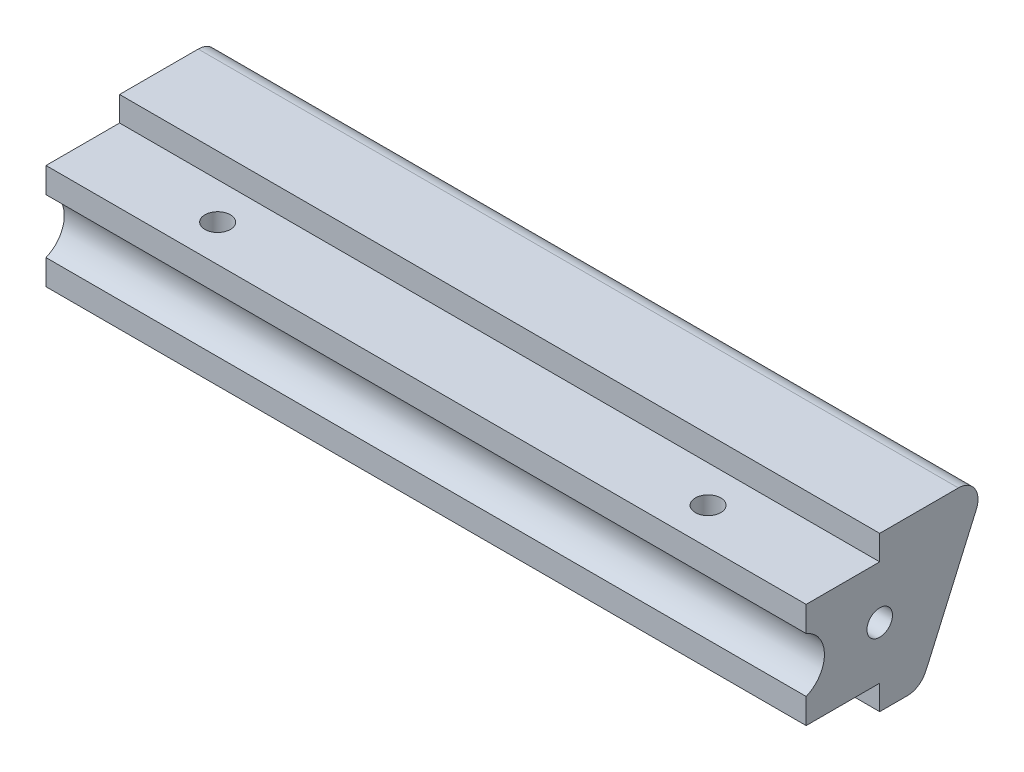
ISO-10303-21;
HEADER;
FILE_DESCRIPTION(('STEP AP214'),'2;1');
FILE_NAME('part.step','',(''),(''),'','','');
FILE_SCHEMA(('AUTOMOTIVE_DESIGN { 1 0 10303 214 1 1 1 1 }'));
ENDSEC;
DATA;
#1=APPLICATION_CONTEXT('core data for automotive mechanical design processes');
#2=APPLICATION_PROTOCOL_DEFINITION('international standard','automotive_design',2000,#1);
#3=PRODUCT_CONTEXT('',#1,'mechanical');
#4=PRODUCT('Part','Part','',(#3));
#5=PRODUCT_RELATED_PRODUCT_CATEGORY('part','',(#4));
#6=PRODUCT_DEFINITION_FORMATION('','',#4);
#7=PRODUCT_DEFINITION_CONTEXT('part definition',#1,'design');
#8=PRODUCT_DEFINITION('design','',#6,#7);
#9=PRODUCT_DEFINITION_SHAPE('','',#8);
#10=(LENGTH_UNIT() NAMED_UNIT(*) SI_UNIT(.MILLI.,.METRE.));
#11=(NAMED_UNIT(*) PLANE_ANGLE_UNIT() SI_UNIT($,.RADIAN.));
#12=(NAMED_UNIT(*) SI_UNIT($,.STERADIAN.) SOLID_ANGLE_UNIT());
#13=UNCERTAINTY_MEASURE_WITH_UNIT(LENGTH_MEASURE(1.E-05),#10,'distance_accuracy_value','');
#14=(GEOMETRIC_REPRESENTATION_CONTEXT(3) GLOBAL_UNCERTAINTY_ASSIGNED_CONTEXT((#13)) GLOBAL_UNIT_ASSIGNED_CONTEXT((#10,
#11,#12)) REPRESENTATION_CONTEXT('',''));
#15=CARTESIAN_POINT('',(0.,0.,0.));
#16=DIRECTION('',(0.,0.,1.));
#17=DIRECTION('',(1.,0.,0.));
#18=AXIS2_PLACEMENT_3D('',#15,#16,#17);
#19=CARTESIAN_POINT('',(98.425,16.7996,0.));
#20=DIRECTION('',(0.,0.,-1.));
#21=DIRECTION('',(0.,1.,0.));
#22=AXIS2_PLACEMENT_3D('',#19,#20,#21);
#23=PLANE('',#22);
#24=DIRECTION('',(0.,-1.,0.));
#25=VECTOR('',#24,1.);
#26=CARTESIAN_POINT('',(98.425,16.7996,0.));
#27=LINE('',#26,#25);
#28=CARTESIAN_POINT('',(98.425,6.4737188141613,0.));
#29=VERTEX_POINT('',#28);
#30=CARTESIAN_POINT('',(98.425,3.2004,0.));
#31=VERTEX_POINT('',#30);
#32=EDGE_CURVE('E145',#29,#31,#27,.T.);
#33=ORIENTED_EDGE('',*,*,#32,.F.);
#34=DIRECTION('',(-1.,0.,0.));
#35=VECTOR('',#34,1.);
#36=CARTESIAN_POINT('',(105.864264117156,6.4737188141613,0.));
#37=LINE('',#36,#35);
#38=CARTESIAN_POINT('',(0.,6.4737188141613,0.));
#39=VERTEX_POINT('',#38);
#40=EDGE_CURVE('E130',#29,#39,#37,.T.);
#41=ORIENTED_EDGE('',*,*,#40,.T.);
#42=DIRECTION('',(0.,-1.,0.));
#43=VECTOR('',#42,1.);
#44=CARTESIAN_POINT('',(0.,16.7996,0.));
#45=LINE('',#44,#43);
#46=CARTESIAN_POINT('',(0.,3.2004,0.));
#47=VERTEX_POINT('',#46);
#48=EDGE_CURVE('E143',#39,#47,#45,.T.);
#49=ORIENTED_EDGE('',*,*,#48,.T.);
#50=DIRECTION('',(-1.,0.,0.));
#51=VECTOR('',#50,1.);
#52=CARTESIAN_POINT('',(98.425,3.2004,0.));
#53=LINE('',#52,#51);
#54=EDGE_CURVE('E180',#31,#47,#53,.T.);
#55=ORIENTED_EDGE('',*,*,#54,.F.);
#56=EDGE_LOOP('',(#33,#41,#49,#55));
#57=FACE_BOUND('',#56,.T.);
#58=ADVANCED_FACE('F33',(#57),#23,.F.);
#59=CARTESIAN_POINT('',(98.425,20.,-23.603930171705));
#60=DIRECTION('',(0.,-1.,0.));
#61=DIRECTION('',(0.,0.,-1.));
#62=AXIS2_PLACEMENT_3D('',#59,#60,#61);
#63=PLANE('',#62);
#64=DIRECTION('',(0.,0.,1.));
#65=VECTOR('',#64,1.);
#66=CARTESIAN_POINT('',(98.425,20.,-23.603930171705));
#67=LINE('',#66,#65);
#68=CARTESIAN_POINT('',(98.425,20.,-19.7136079095898));
#69=VERTEX_POINT('',#68);
#70=CARTESIAN_POINT('',(98.425,20.,-9.525));
#71=VERTEX_POINT('',#70);
#72=EDGE_CURVE('E169',#69,#71,#67,.T.);
#73=ORIENTED_EDGE('',*,*,#72,.F.);
#74=DIRECTION('',(-1.,0.,0.));
#75=VECTOR('',#74,1.);
#76=CARTESIAN_POINT('',(98.425,20.,-19.7136079095898));
#77=LINE('',#76,#75);
#78=CARTESIAN_POINT('',(0.,20.,-19.7136079095898));
#79=VERTEX_POINT('',#78);
#80=EDGE_CURVE('E41',#69,#79,#77,.T.);
#81=ORIENTED_EDGE('',*,*,#80,.T.);
#82=DIRECTION('',(0.,0.,1.));
#83=VECTOR('',#82,1.);
#84=CARTESIAN_POINT('',(0.,20.,-23.603930171705));
#85=LINE('',#84,#83);
#86=CARTESIAN_POINT('',(0.,20.,-9.525));
#87=VERTEX_POINT('',#86);
#88=EDGE_CURVE('E208',#79,#87,#85,.T.);
#89=ORIENTED_EDGE('',*,*,#88,.T.);
#90=DIRECTION('',(-1.,0.,0.));
#91=VECTOR('',#90,1.);
#92=CARTESIAN_POINT('',(98.425,20.,-9.525));
#93=LINE('',#92,#91);
#94=EDGE_CURVE('E188',#71,#87,#93,.T.);
#95=ORIENTED_EDGE('',*,*,#94,.F.);
#96=EDGE_LOOP('',(#73,#81,#89,#95));
#97=FACE_BOUND('',#96,.T.);
#98=ADVANCED_FACE('F206',(#97),#63,.F.);
#99=CARTESIAN_POINT('',(98.425,20.,-9.525));
#100=DIRECTION('',(0.,0.,-1.));
#101=DIRECTION('',(-1.,0.,0.));
#102=AXIS2_PLACEMENT_3D('',#99,#100,#101);
#103=PLANE('',#102);
#104=DIRECTION('',(0.,-1.,0.));
#105=VECTOR('',#104,1.);
#106=CARTESIAN_POINT('',(0.,20.,-9.525));
#107=LINE('',#106,#105);
#108=CARTESIAN_POINT('',(0.,16.7996,-9.525));
#109=VERTEX_POINT('',#108);
#110=EDGE_CURVE('E155',#87,#109,#107,.T.);
#111=ORIENTED_EDGE('',*,*,#110,.T.);
#112=DIRECTION('',(-1.,0.,0.));
#113=VECTOR('',#112,1.);
#114=CARTESIAN_POINT('',(98.425,16.7996,-9.525));
#115=LINE('',#114,#113);
#116=CARTESIAN_POINT('',(98.425,16.7996,-9.525));
#117=VERTEX_POINT('',#116);
#118=EDGE_CURVE('E185',#117,#109,#115,.T.);
#119=ORIENTED_EDGE('',*,*,#118,.F.);
#120=DIRECTION('',(0.,-1.,0.));
#121=VECTOR('',#120,1.);
#122=CARTESIAN_POINT('',(98.425,20.,-9.525));
#123=LINE('',#122,#121);
#124=EDGE_CURVE('E232',#71,#117,#123,.T.);
#125=ORIENTED_EDGE('',*,*,#124,.F.);
#126=ORIENTED_EDGE('',*,*,#94,.T.);
#127=EDGE_LOOP('',(#111,#119,#125,#126));
#128=FACE_BOUND('',#127,.T.);
#129=ADVANCED_FACE('F288',(#128),#103,.F.);
#130=CARTESIAN_POINT('',(98.425,16.7996,-9.525));
#131=DIRECTION('',(0.,-1.,0.));
#132=DIRECTION('',(0.,0.,-1.));
#133=AXIS2_PLACEMENT_3D('',#130,#131,#132);
#134=PLANE('',#133);
#135=CARTESIAN_POINT('',(17.4625,16.7996,-4.76250000000001));
#136=DIRECTION('',(0.,1.,0.));
#137=DIRECTION('',(0.,0.,1.));
#138=AXIS2_PLACEMENT_3D('',#135,#136,#137);
#139=CIRCLE('',#138,1.651);
#140=CARTESIAN_POINT('',(17.4625,16.7996,-3.11150000000001));
#141=VERTEX_POINT('',#140);
#142=EDGE_CURVE('E239',#141,#141,#139,.T.);
#143=ORIENTED_EDGE('',*,*,#142,.F.);
#144=EDGE_LOOP('',(#143));
#145=FACE_BOUND('',#144,.T.);
#146=CARTESIAN_POINT('',(80.9625,16.7996,-4.76250000000005));
#147=DIRECTION('',(0.,1.,0.));
#148=DIRECTION('',(0.,0.,1.));
#149=AXIS2_PLACEMENT_3D('',#146,#147,#148);
#150=CIRCLE('',#149,1.65100000000001);
#151=CARTESIAN_POINT('',(80.9625,16.7996,-3.11150000000004));
#152=VERTEX_POINT('',#151);
#153=EDGE_CURVE('E240',#152,#152,#150,.T.);
#154=ORIENTED_EDGE('',*,*,#153,.F.);
#155=EDGE_LOOP('',(#154));
#156=FACE_BOUND('',#155,.T.);
#157=DIRECTION('',(0.,0.,1.));
#158=VECTOR('',#157,1.);
#159=CARTESIAN_POINT('',(0.,16.7996,-9.525));
#160=LINE('',#159,#158);
#161=CARTESIAN_POINT('',(0.,16.7996,0.));
#162=VERTEX_POINT('',#161);
#163=EDGE_CURVE('E153',#109,#162,#160,.T.);
#164=ORIENTED_EDGE('',*,*,#163,.T.);
#165=DIRECTION('',(-1.,0.,0.));
#166=VECTOR('',#165,1.);
#167=CARTESIAN_POINT('',(98.425,16.7996,0.));
#168=LINE('',#167,#166);
#169=CARTESIAN_POINT('',(98.425,16.7996,0.));
#170=VERTEX_POINT('',#169);
#171=EDGE_CURVE('E182',#170,#162,#168,.T.);
#172=ORIENTED_EDGE('',*,*,#171,.F.);
#173=DIRECTION('',(0.,0.,1.));
#174=VECTOR('',#173,1.);
#175=CARTESIAN_POINT('',(98.425,16.7996,-9.525));
#176=LINE('',#175,#174);
#177=EDGE_CURVE('E230',#117,#170,#176,.T.);
#178=ORIENTED_EDGE('',*,*,#177,.F.);
#179=ORIENTED_EDGE('',*,*,#118,.T.);
#180=EDGE_LOOP('',(#164,#172,#178,#179));
#181=FACE_BOUND('',#180,.T.);
#182=ADVANCED_FACE('F294',(#145,#156,#181),#134,.F.);
#183=CARTESIAN_POINT('',(0.,13.5262811858387,0.));
#184=VERTEX_POINT('',#183);
#185=EDGE_CURVE('E152',#162,#184,#45,.T.);
#186=ORIENTED_EDGE('',*,*,#185,.T.);
#187=DIRECTION('',(-1.,0.,0.));
#188=VECTOR('',#187,1.);
#189=CARTESIAN_POINT('',(105.864264117156,13.5262811858387,0.));
#190=LINE('',#189,#188);
#191=CARTESIAN_POINT('',(98.425,13.5262811858387,0.));
#192=VERTEX_POINT('',#191);
#193=EDGE_CURVE('E133',#192,#184,#190,.T.);
#194=ORIENTED_EDGE('',*,*,#193,.F.);
#195=EDGE_CURVE('E227',#170,#192,#27,.T.);
#196=ORIENTED_EDGE('',*,*,#195,.F.);
#197=ORIENTED_EDGE('',*,*,#171,.T.);
#198=EDGE_LOOP('',(#186,#194,#196,#197));
#199=FACE_BOUND('',#198,.T.);
#200=ADVANCED_FACE('F284',(#199),#23,.F.);
#201=CARTESIAN_POINT('',(98.425,3.2004,0.));
#202=DIRECTION('',(0.,1.,0.));
#203=DIRECTION('',(0.,0.,1.));
#204=AXIS2_PLACEMENT_3D('',#201,#202,#203);
#205=PLANE('',#204);
#206=CARTESIAN_POINT('',(17.4625,3.2004,-4.76250000000001));
#207=DIRECTION('',(0.,1.,0.));
#208=DIRECTION('',(0.,0.,1.));
#209=AXIS2_PLACEMENT_3D('',#206,#207,#208);
#210=CIRCLE('',#209,1.651);
#211=CARTESIAN_POINT('',(17.4625,3.2004,-3.11150000000001));
#212=VERTEX_POINT('',#211);
#213=EDGE_CURVE('E138',#212,#212,#210,.F.);
#214=ORIENTED_EDGE('',*,*,#213,.F.);
#215=EDGE_LOOP('',(#214));
#216=FACE_BOUND('',#215,.T.);
#217=CARTESIAN_POINT('',(80.9625,3.2004,-4.76250000000005));
#218=DIRECTION('',(0.,1.,0.));
#219=DIRECTION('',(0.,0.,1.));
#220=AXIS2_PLACEMENT_3D('',#217,#218,#219);
#221=CIRCLE('',#220,1.65100000000001);
#222=CARTESIAN_POINT('',(80.9625,3.2004,-3.11150000000005));
#223=VERTEX_POINT('',#222);
#224=EDGE_CURVE('E236',#223,#223,#221,.F.);
#225=ORIENTED_EDGE('',*,*,#224,.F.);
#226=EDGE_LOOP('',(#225));
#227=FACE_BOUND('',#226,.T.);
#228=DIRECTION('',(0.,0.,-1.));
#229=VECTOR('',#228,1.);
#230=CARTESIAN_POINT('',(0.,3.2004,0.));
#231=LINE('',#230,#229);
#232=CARTESIAN_POINT('',(0.,3.2004,-9.525));
#233=VERTEX_POINT('',#232);
#234=EDGE_CURVE('E151',#47,#233,#231,.T.);
#235=ORIENTED_EDGE('',*,*,#234,.T.);
#236=DIRECTION('',(-1.,0.,0.));
#237=VECTOR('',#236,1.);
#238=CARTESIAN_POINT('',(98.425,3.2004,-9.525));
#239=LINE('',#238,#237);
#240=CARTESIAN_POINT('',(98.425,3.2004,-9.525));
#241=VERTEX_POINT('',#240);
#242=EDGE_CURVE('E177',#241,#233,#239,.T.);
#243=ORIENTED_EDGE('',*,*,#242,.F.);
#244=DIRECTION('',(0.,0.,-1.));
#245=VECTOR('',#244,1.);
#246=CARTESIAN_POINT('',(98.425,3.2004,0.));
#247=LINE('',#246,#245);
#248=EDGE_CURVE('E225',#31,#241,#247,.T.);
#249=ORIENTED_EDGE('',*,*,#248,.F.);
#250=ORIENTED_EDGE('',*,*,#54,.T.);
#251=EDGE_LOOP('',(#235,#243,#249,#250));
#252=FACE_BOUND('',#251,.T.);
#253=ADVANCED_FACE('F293',(#216,#227,#252),#205,.F.);
#254=CARTESIAN_POINT('',(98.425,3.2004,-9.525));
#255=DIRECTION('',(0.,0.,-1.));
#256=DIRECTION('',(0.,1.,0.));
#257=AXIS2_PLACEMENT_3D('',#254,#255,#256);
#258=PLANE('',#257);
#259=DIRECTION('',(0.,-1.,0.));
#260=VECTOR('',#259,1.);
#261=CARTESIAN_POINT('',(0.,3.2004,-9.525));
#262=LINE('',#261,#260);
#263=CARTESIAN_POINT('',(0.,0.,-9.525));
#264=VERTEX_POINT('',#263);
#265=EDGE_CURVE('E160',#233,#264,#262,.T.);
#266=ORIENTED_EDGE('',*,*,#265,.T.);
#267=DIRECTION('',(-1.,0.,0.));
#268=VECTOR('',#267,1.);
#269=CARTESIAN_POINT('',(98.425,0.,-9.525));
#270=LINE('',#269,#268);
#271=CARTESIAN_POINT('',(98.425,0.,-9.525));
#272=VERTEX_POINT('',#271);
#273=EDGE_CURVE('E173',#272,#264,#270,.T.);
#274=ORIENTED_EDGE('',*,*,#273,.F.);
#275=DIRECTION('',(0.,-1.,0.));
#276=VECTOR('',#275,1.);
#277=CARTESIAN_POINT('',(98.425,3.2004,-9.525));
#278=LINE('',#277,#276);
#279=EDGE_CURVE('E223',#241,#272,#278,.T.);
#280=ORIENTED_EDGE('',*,*,#279,.F.);
#281=ORIENTED_EDGE('',*,*,#242,.T.);
#282=EDGE_LOOP('',(#266,#274,#280,#281));
#283=FACE_BOUND('',#282,.T.);
#284=ADVANCED_FACE('F300',(#283),#258,.F.);
#285=CARTESIAN_POINT('',(98.425,0.,-14.605));
#286=DIRECTION('',(0.,1.,0.));
#287=DIRECTION('',(0.,0.,1.));
#288=AXIS2_PLACEMENT_3D('',#285,#286,#287);
#289=PLANE('',#288);
#290=DIRECTION('',(0.,0.,-1.));
#291=VECTOR('',#290,1.);
#292=CARTESIAN_POINT('',(0.,0.,-14.605));
#293=LINE('',#292,#291);
#294=CARTESIAN_POINT('',(0.,0.,-13.1269577210068));
#295=VERTEX_POINT('',#294);
#296=EDGE_CURVE('E162',#264,#295,#293,.T.);
#297=ORIENTED_EDGE('',*,*,#296,.T.);
#298=DIRECTION('',(-1.,0.,0.));
#299=VECTOR('',#298,1.);
#300=CARTESIAN_POINT('',(98.425,0.,-13.1269577210068));
#301=LINE('',#300,#299);
#302=CARTESIAN_POINT('',(98.425,0.,-13.1269577210068));
#303=VERTEX_POINT('',#302);
#304=EDGE_CURVE('E198',#295,#303,#301,.F.);
#305=ORIENTED_EDGE('',*,*,#304,.T.);
#306=DIRECTION('',(0.,0.,-1.));
#307=VECTOR('',#306,1.);
#308=CARTESIAN_POINT('',(98.425,0.,-14.605));
#309=LINE('',#308,#307);
#310=EDGE_CURVE('E220',#272,#303,#309,.T.);
#311=ORIENTED_EDGE('',*,*,#310,.F.);
#312=ORIENTED_EDGE('',*,*,#273,.T.);
#313=EDGE_LOOP('',(#297,#305,#311,#312));
#314=FACE_BOUND('',#313,.T.);
#315=ADVANCED_FACE('F314',(#314),#289,.F.);
#316=CARTESIAN_POINT('',(98.425,10.0000002134811,1.44191197545425));
#317=DIRECTION('',(-1.,0.,0.));
#318=DIRECTION('',(0.,0.,1.));
#319=AXIS2_PLACEMENT_3D('',#316,#317,#318);
#320=CYLINDRICAL_SURFACE('',#319,18.90776);
#321=CARTESIAN_POINT('',(98.425,10.0000002134811,1.44191197545425));
#322=DIRECTION('',(1.,0.,0.));
#323=DIRECTION('',(0.,0.,1.));
#324=AXIS2_PLACEMENT_3D('',#321,#322,#323);
#325=CIRCLE('',#324,18.90776);
#326=CARTESIAN_POINT('',(98.425,1.38233392093713,-15.387800318223));
#327=VERTEX_POINT('',#326);
#328=CARTESIAN_POINT('',(98.425,2.39439280593137,-15.8687241821173));
#329=VERTEX_POINT('',#328);
#330=EDGE_CURVE('E218',#327,#329,#325,.T.);
#331=ORIENTED_EDGE('',*,*,#330,.F.);
#332=DIRECTION('',(-1.,0.,0.));
#333=VECTOR('',#332,1.);
#334=CARTESIAN_POINT('',(98.425,1.38233392093713,-15.387800318223));
#335=LINE('',#334,#333);
#336=CARTESIAN_POINT('',(0.,1.38233392093713,-15.387800318223));
#337=VERTEX_POINT('',#336);
#338=EDGE_CURVE('E191',#327,#337,#335,.T.);
#339=ORIENTED_EDGE('',*,*,#338,.T.);
#340=CARTESIAN_POINT('',(0.,10.0000002134811,1.44191197545425));
#341=DIRECTION('',(1.,0.,0.));
#342=DIRECTION('',(0.,0.,1.));
#343=AXIS2_PLACEMENT_3D('',#340,#341,#342);
#344=CIRCLE('',#343,18.90776);
#345=CARTESIAN_POINT('',(0.,2.39439280593137,-15.8687241821173));
#346=VERTEX_POINT('',#345);
#347=EDGE_CURVE('E165',#337,#346,#344,.T.);
#348=ORIENTED_EDGE('',*,*,#347,.T.);
#349=DIRECTION('',(-1.,0.,0.));
#350=VECTOR('',#349,1.);
#351=CARTESIAN_POINT('',(98.425,2.39439280593137,-15.8687241821173));
#352=LINE('',#351,#350);
#353=EDGE_CURVE('E170',#329,#346,#352,.T.);
#354=ORIENTED_EDGE('',*,*,#353,.F.);
#355=EDGE_LOOP('',(#331,#339,#348,#354));
#356=FACE_BOUND('',#355,.T.);
#357=ADVANCED_FACE('F272',(#356),#320,.T.);
#358=CARTESIAN_POINT('',(98.425,20.,-23.603930171705));
#359=DIRECTION('',(0.,0.402247934580816,0.915530774537627));
#360=DIRECTION('',(0.,-0.915530774537627,0.402247934580816));
#361=AXIS2_PLACEMENT_3D('',#358,#359,#360);
#362=PLANE('',#361);
#363=DIRECTION('',(0.,0.915530774537627,-0.402247934580816));
#364=VECTOR('',#363,1.);
#365=CARTESIAN_POINT('',(0.,20.,-23.603930171705));
#366=LINE('',#365,#364);
#367=CARTESIAN_POINT('',(0.,16.4382902461647,-22.0390560769154));
#368=VERTEX_POINT('',#367);
#369=EDGE_CURVE('E167',#346,#368,#366,.T.);
#370=ORIENTED_EDGE('',*,*,#369,.T.);
#371=DIRECTION('',(-1.,0.,0.));
#372=VECTOR('',#371,1.);
#373=CARTESIAN_POINT('',(98.425,16.4382902461647,-22.0390560769154));
#374=LINE('',#373,#372);
#375=CARTESIAN_POINT('',(98.425,16.4382902461647,-22.0390560769154));
#376=VERTEX_POINT('',#375);
#377=EDGE_CURVE('E11',#368,#376,#374,.F.);
#378=ORIENTED_EDGE('',*,*,#377,.T.);
#379=DIRECTION('',(0.,0.915530774537627,-0.402247934580816));
#380=VECTOR('',#379,1.);
#381=CARTESIAN_POINT('',(98.425,20.,-23.603930171705));
#382=LINE('',#381,#380);
#383=EDGE_CURVE('E174',#329,#376,#382,.T.);
#384=ORIENTED_EDGE('',*,*,#383,.F.);
#385=ORIENTED_EDGE('',*,*,#353,.T.);
#386=EDGE_LOOP('',(#370,#378,#384,#385));
#387=FACE_BOUND('',#386,.T.);
#388=ADVANCED_FACE('F259',(#387),#362,.F.);
#389=CARTESIAN_POINT('',(98.425,10.0000002134811,1.44191197545425));
#390=DIRECTION('',(-1.,0.,0.));
#391=DIRECTION('',(0.,0.,1.));
#392=AXIS2_PLACEMENT_3D('',#389,#390,#391);
#393=PLANE('',#392);
#394=CARTESIAN_POINT('',(98.425,10.,-9.525));
#395=DIRECTION('',(1.,0.,0.));
#396=DIRECTION('',(0.,0.,-1.));
#397=AXIS2_PLACEMENT_3D('',#394,#395,#396);
#398=CIRCLE('',#397,1.651);
#399=CARTESIAN_POINT('',(98.425,10.,-11.176));
#400=VERTEX_POINT('',#399);
#401=EDGE_CURVE('E250',#400,#400,#398,.T.);
#402=ORIENTED_EDGE('',*,*,#401,.F.);
#403=EDGE_LOOP('',(#402));
#404=FACE_BOUND('',#403,.T.);
#405=ORIENTED_EDGE('',*,*,#310,.T.);
#406=CARTESIAN_POINT('',(98.425,2.54,-13.1269577210068));
#407=DIRECTION('',(-1.,0.,0.));
#408=DIRECTION('',(0.,0.,1.));
#409=AXIS2_PLACEMENT_3D('',#406,#407,#408);
#410=CIRCLE('',#409,2.54);
#411=EDGE_CURVE('E201',#303,#327,#410,.F.);
#412=ORIENTED_EDGE('',*,*,#411,.T.);
#413=ORIENTED_EDGE('',*,*,#330,.T.);
#414=ORIENTED_EDGE('',*,*,#383,.T.);
#415=CARTESIAN_POINT('',(98.425,17.46,-19.7136079095898));
#416=DIRECTION('',(-1.,0.,0.));
#417=DIRECTION('',(0.,0.,1.));
#418=AXIS2_PLACEMENT_3D('',#415,#416,#417);
#419=CIRCLE('',#418,2.54);
#420=EDGE_CURVE('E48',#376,#69,#419,.F.);
#421=ORIENTED_EDGE('',*,*,#420,.T.);
#422=ORIENTED_EDGE('',*,*,#72,.T.);
#423=ORIENTED_EDGE('',*,*,#124,.T.);
#424=ORIENTED_EDGE('',*,*,#177,.T.);
#425=ORIENTED_EDGE('',*,*,#195,.T.);
#426=CARTESIAN_POINT('',(98.425,10.,1.44272));
#427=DIRECTION('',(-1.,0.,0.));
#428=DIRECTION('',(0.,0.,1.));
#429=AXIS2_PLACEMENT_3D('',#426,#427,#428);
#430=CIRCLE('',#429,3.81);
#431=EDGE_CURVE('E213',#29,#192,#430,.F.);
#432=ORIENTED_EDGE('',*,*,#431,.F.);
#433=ORIENTED_EDGE('',*,*,#32,.T.);
#434=ORIENTED_EDGE('',*,*,#248,.T.);
#435=ORIENTED_EDGE('',*,*,#279,.T.);
#436=EDGE_LOOP('',(#405,#412,#413,#414,#421,#422,#423,#424,#425,#432,#433,#434,#435));
#437=FACE_BOUND('',#436,.T.);
#438=ADVANCED_FACE('F257',(#404,#437),#393,.F.);
#439=CARTESIAN_POINT('',(0.,10.0000002134811,1.44191197545425));
#440=DIRECTION('',(-1.,0.,0.));
#441=DIRECTION('',(0.,0.,1.));
#442=AXIS2_PLACEMENT_3D('',#439,#440,#441);
#443=PLANE('',#442);
#444=CARTESIAN_POINT('',(0.,10.,-9.525));
#445=DIRECTION('',(-1.,0.,0.));
#446=DIRECTION('',(0.,0.,1.));
#447=AXIS2_PLACEMENT_3D('',#444,#445,#446);
#448=CIRCLE('',#447,1.651);
#449=CARTESIAN_POINT('',(0.,10.,-7.874));
#450=VERTEX_POINT('',#449);
#451=EDGE_CURVE('E243',#450,#450,#448,.F.);
#452=ORIENTED_EDGE('',*,*,#451,.T.);
#453=EDGE_LOOP('',(#452));
#454=FACE_BOUND('',#453,.T.);
#455=ORIENTED_EDGE('',*,*,#347,.F.);
#456=CARTESIAN_POINT('',(0.,2.54,-13.1269577210068));
#457=DIRECTION('',(-1.,0.,0.));
#458=DIRECTION('',(0.,0.,1.));
#459=AXIS2_PLACEMENT_3D('',#456,#457,#458);
#460=CIRCLE('',#459,2.54);
#461=EDGE_CURVE('E196',#337,#295,#460,.T.);
#462=ORIENTED_EDGE('',*,*,#461,.T.);
#463=ORIENTED_EDGE('',*,*,#296,.F.);
#464=ORIENTED_EDGE('',*,*,#265,.F.);
#465=ORIENTED_EDGE('',*,*,#234,.F.);
#466=ORIENTED_EDGE('',*,*,#48,.F.);
#467=CARTESIAN_POINT('',(0.,10.,1.44272));
#468=DIRECTION('',(-1.,0.,0.));
#469=DIRECTION('',(0.,0.,1.));
#470=AXIS2_PLACEMENT_3D('',#467,#468,#469);
#471=CIRCLE('',#470,3.81);
#472=EDGE_CURVE('E127',#184,#39,#471,.T.);
#473=ORIENTED_EDGE('',*,*,#472,.F.);
#474=ORIENTED_EDGE('',*,*,#185,.F.);
#475=ORIENTED_EDGE('',*,*,#163,.F.);
#476=ORIENTED_EDGE('',*,*,#110,.F.);
#477=ORIENTED_EDGE('',*,*,#88,.F.);
#478=CARTESIAN_POINT('',(0.,17.46,-19.7136079095898));
#479=DIRECTION('',(-1.,0.,0.));
#480=DIRECTION('',(0.,0.,1.));
#481=AXIS2_PLACEMENT_3D('',#478,#479,#480);
#482=CIRCLE('',#481,2.54);
#483=EDGE_CURVE('E194',#79,#368,#482,.T.);
#484=ORIENTED_EDGE('',*,*,#483,.T.);
#485=ORIENTED_EDGE('',*,*,#369,.F.);
#486=EDGE_LOOP('',(#455,#462,#463,#464,#465,#466,#473,#474,#475,#476,#477,#484,#485));
#487=FACE_BOUND('',#486,.T.);
#488=ADVANCED_FACE('F149',(#454,#487),#443,.T.);
#489=CARTESIAN_POINT('',(105.864264117156,10.,1.44272));
#490=DIRECTION('',(-1.,0.,0.));
#491=DIRECTION('',(0.,0.,1.));
#492=AXIS2_PLACEMENT_3D('',#489,#490,#491);
#493=CYLINDRICAL_SURFACE('',#492,3.81);
#494=ORIENTED_EDGE('',*,*,#431,.T.);
#495=ORIENTED_EDGE('',*,*,#193,.T.);
#496=ORIENTED_EDGE('',*,*,#472,.T.);
#497=ORIENTED_EDGE('',*,*,#40,.F.);
#498=EDGE_LOOP('',(#494,#495,#496,#497));
#499=FACE_BOUND('',#498,.T.);
#500=ADVANCED_FACE('F129',(#499),#493,.F.);
#501=CARTESIAN_POINT('',(80.9625,-1.46933318295597,-4.76250000000005));
#502=DIRECTION('',(0.,1.,0.));
#503=DIRECTION('',(0.,0.,1.));
#504=AXIS2_PLACEMENT_3D('',#501,#502,#503);
#505=CYLINDRICAL_SURFACE('',#504,1.65100000000001);
#506=ORIENTED_EDGE('',*,*,#224,.T.);
#507=EDGE_LOOP('',(#506));
#508=FACE_BOUND('',#507,.T.);
#509=ORIENTED_EDGE('',*,*,#153,.T.);
#510=EDGE_LOOP('',(#509));
#511=FACE_BOUND('',#510,.T.);
#512=ADVANCED_FACE('F331',(#508,#511),#505,.F.);
#513=CARTESIAN_POINT('',(17.4625,-1.46933318295597,-4.76250000000001));
#514=DIRECTION('',(0.,1.,0.));
#515=DIRECTION('',(0.,0.,1.));
#516=AXIS2_PLACEMENT_3D('',#513,#514,#515);
#517=CYLINDRICAL_SURFACE('',#516,1.651);
#518=ORIENTED_EDGE('',*,*,#213,.T.);
#519=EDGE_LOOP('',(#518));
#520=FACE_BOUND('',#519,.T.);
#521=ORIENTED_EDGE('',*,*,#142,.T.);
#522=EDGE_LOOP('',(#521));
#523=FACE_BOUND('',#522,.T.);
#524=ADVANCED_FACE('F281',(#520,#523),#517,.F.);
#525=CARTESIAN_POINT('',(98.425,2.54,-13.1269577210068));
#526=DIRECTION('',(-1.,0.,0.));
#527=DIRECTION('',(0.,0.,1.));
#528=AXIS2_PLACEMENT_3D('',#525,#526,#527);
#529=CYLINDRICAL_SURFACE('',#528,2.54);
#530=ORIENTED_EDGE('',*,*,#411,.F.);
#531=ORIENTED_EDGE('',*,*,#304,.F.);
#532=ORIENTED_EDGE('',*,*,#461,.F.);
#533=ORIENTED_EDGE('',*,*,#338,.F.);
#534=EDGE_LOOP('',(#530,#531,#532,#533));
#535=FACE_BOUND('',#534,.T.);
#536=ADVANCED_FACE('F270',(#535),#529,.T.);
#537=CARTESIAN_POINT('',(98.425,17.46,-19.7136079095898));
#538=DIRECTION('',(-1.,0.,0.));
#539=DIRECTION('',(0.,0.,1.));
#540=AXIS2_PLACEMENT_3D('',#537,#538,#539);
#541=CYLINDRICAL_SURFACE('',#540,2.54);
#542=ORIENTED_EDGE('',*,*,#420,.F.);
#543=ORIENTED_EDGE('',*,*,#377,.F.);
#544=ORIENTED_EDGE('',*,*,#483,.F.);
#545=ORIENTED_EDGE('',*,*,#80,.F.);
#546=EDGE_LOOP('',(#542,#543,#544,#545));
#547=FACE_BOUND('',#546,.T.);
#548=ADVANCED_FACE('F35',(#547),#541,.T.);
#549=CARTESIAN_POINT('',(-4.66973318295596,10.,-9.525));
#550=DIRECTION('',(1.,0.,0.));
#551=DIRECTION('',(0.,0.,-1.));
#552=AXIS2_PLACEMENT_3D('',#549,#550,#551);
#553=CYLINDRICAL_SURFACE('',#552,1.651);
#554=ORIENTED_EDGE('',*,*,#401,.T.);
#555=EDGE_LOOP('',(#554));
#556=FACE_BOUND('',#555,.T.);
#557=ORIENTED_EDGE('',*,*,#451,.F.);
#558=EDGE_LOOP('',(#557));
#559=FACE_BOUND('',#558,.T.);
#560=ADVANCED_FACE('F254',(#556,#559),#553,.F.);
#561=CLOSED_SHELL('',(#58,#98,#129,#182,#200,#253,#284,#315,#357,#388,#438,#488,#500,#512,#524,
#536,#548,#560));
#562=MANIFOLD_SOLID_BREP('B2',#561);
#563=ADVANCED_BREP_SHAPE_REPRESENTATION('',(#18,#562),#14);
#564=SHAPE_DEFINITION_REPRESENTATION(#9,#563);
ENDSEC;
END-ISO-10303-21;
